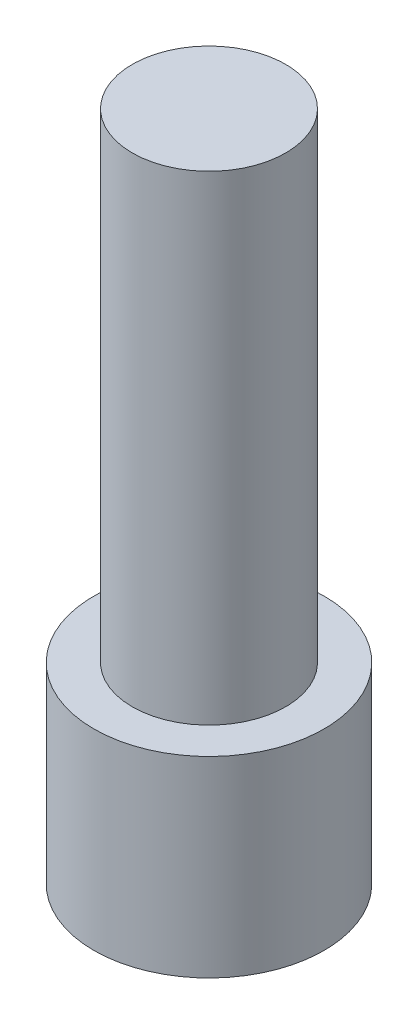
ISO-10303-21;
HEADER;
FILE_DESCRIPTION(('STEP AP214'),'2;1');
FILE_NAME('part.step','',(''),(''),'','','');
FILE_SCHEMA(('AUTOMOTIVE_DESIGN { 1 0 10303 214 1 1 1 1 }'));
ENDSEC;
DATA;
#1=APPLICATION_CONTEXT('core data for automotive mechanical design processes');
#2=APPLICATION_PROTOCOL_DEFINITION('international standard','automotive_design',2000,#1);
#3=PRODUCT_CONTEXT('',#1,'mechanical');
#4=PRODUCT('Part','Part','',(#3));
#5=PRODUCT_RELATED_PRODUCT_CATEGORY('part','',(#4));
#6=PRODUCT_DEFINITION_FORMATION('','',#4);
#7=PRODUCT_DEFINITION_CONTEXT('part definition',#1,'design');
#8=PRODUCT_DEFINITION('design','',#6,#7);
#9=PRODUCT_DEFINITION_SHAPE('','',#8);
#10=(LENGTH_UNIT() NAMED_UNIT(*) SI_UNIT(.MILLI.,.METRE.));
#11=(NAMED_UNIT(*) PLANE_ANGLE_UNIT() SI_UNIT($,.RADIAN.));
#12=(NAMED_UNIT(*) SI_UNIT($,.STERADIAN.) SOLID_ANGLE_UNIT());
#13=UNCERTAINTY_MEASURE_WITH_UNIT(LENGTH_MEASURE(1.E-05),#10,'distance_accuracy_value','');
#14=(GEOMETRIC_REPRESENTATION_CONTEXT(3) GLOBAL_UNCERTAINTY_ASSIGNED_CONTEXT((#13)) GLOBAL_UNIT_ASSIGNED_CONTEXT((#10,
#11,#12)) REPRESENTATION_CONTEXT('',''));
#15=CARTESIAN_POINT('',(0.,0.,0.));
#16=DIRECTION('',(0.,0.,1.));
#17=DIRECTION('',(1.,0.,0.));
#18=AXIS2_PLACEMENT_3D('',#15,#16,#17);
#19=CARTESIAN_POINT('',(0.,25.,0.));
#20=DIRECTION('',(0.,-1.,0.));
#21=DIRECTION('',(0.,0.,-1.));
#22=AXIS2_PLACEMENT_3D('',#19,#20,#21);
#23=CYLINDRICAL_SURFACE('',#22,4.);
#24=CARTESIAN_POINT('',(0.,25.,0.));
#25=DIRECTION('',(0.,1.,0.));
#26=DIRECTION('',(0.,0.,1.));
#27=AXIS2_PLACEMENT_3D('',#24,#25,#26);
#28=CIRCLE('',#27,4.);
#29=CARTESIAN_POINT('',(0.,25.,4.));
#30=VERTEX_POINT('',#29);
#31=EDGE_CURVE('E12',#30,#30,#28,.T.);
#32=ORIENTED_EDGE('',*,*,#31,.F.);
#33=EDGE_LOOP('',(#32));
#34=FACE_BOUND('',#33,.T.);
#35=CARTESIAN_POINT('',(0.,0.,0.));
#36=DIRECTION('',(0.,1.,0.));
#37=DIRECTION('',(0.,0.,1.));
#38=AXIS2_PLACEMENT_3D('',#35,#36,#37);
#39=CIRCLE('',#38,4.);
#40=CARTESIAN_POINT('',(0.,0.,4.));
#41=VERTEX_POINT('',#40);
#42=EDGE_CURVE('E66',#41,#41,#39,.T.);
#43=ORIENTED_EDGE('',*,*,#42,.T.);
#44=EDGE_LOOP('',(#43));
#45=FACE_BOUND('',#44,.T.);
#46=ADVANCED_FACE('F63',(#34,#45),#23,.T.);
#47=CARTESIAN_POINT('',(0.,25.,0.));
#48=DIRECTION('',(0.,1.,0.));
#49=DIRECTION('',(0.,0.,1.));
#50=AXIS2_PLACEMENT_3D('',#47,#48,#49);
#51=PLANE('',#50);
#52=ORIENTED_EDGE('',*,*,#31,.T.);
#53=EDGE_LOOP('',(#52));
#54=FACE_BOUND('',#53,.T.);
#55=ADVANCED_FACE('F202',(#54),#51,.T.);
#56=CARTESIAN_POINT('',(0.,0.,0.));
#57=DIRECTION('',(0.,-1.,0.));
#58=DIRECTION('',(0.,0.,-1.));
#59=AXIS2_PLACEMENT_3D('',#56,#57,#58);
#60=PLANE('',#59);
#61=ORIENTED_EDGE('',*,*,#42,.F.);
#62=EDGE_LOOP('',(#61));
#63=FACE_BOUND('',#62,.T.);
#64=CARTESIAN_POINT('',(0.,0.,0.));
#65=DIRECTION('',(0.,-1.,0.));
#66=DIRECTION('',(0.,0.,-1.));
#67=AXIS2_PLACEMENT_3D('',#64,#65,#66);
#68=CIRCLE('',#67,6.);
#69=CARTESIAN_POINT('',(0.,0.,-6.));
#70=VERTEX_POINT('',#69);
#71=EDGE_CURVE('E188',#70,#70,#68,.T.);
#72=ORIENTED_EDGE('',*,*,#71,.F.);
#73=EDGE_LOOP('',(#72));
#74=FACE_BOUND('',#73,.T.);
#75=ADVANCED_FACE('F198',(#63,#74),#60,.F.);
#76=CARTESIAN_POINT('',(0.,-3.,0.));
#77=DIRECTION('',(0.,1.,0.));
#78=DIRECTION('',(0.,0.,1.));
#79=AXIS2_PLACEMENT_3D('',#76,#77,#78);
#80=CYLINDRICAL_SURFACE('',#79,6.);
#81=ORIENTED_EDGE('',*,*,#71,.T.);
#82=EDGE_LOOP('',(#81));
#83=FACE_BOUND('',#82,.T.);
#84=CARTESIAN_POINT('',(0.,-10.,0.));
#85=DIRECTION('',(0.,-1.,0.));
#86=DIRECTION('',(0.,0.,-1.));
#87=AXIS2_PLACEMENT_3D('',#84,#85,#86);
#88=CIRCLE('',#87,6.);
#89=CARTESIAN_POINT('',(0.,-10.,-6.));
#90=VERTEX_POINT('',#89);
#91=EDGE_CURVE('E132',#90,#90,#88,.T.);
#92=ORIENTED_EDGE('',*,*,#91,.F.);
#93=EDGE_LOOP('',(#92));
#94=FACE_BOUND('',#93,.T.);
#95=ADVANCED_FACE('F201',(#83,#94),#80,.T.);
#96=CARTESIAN_POINT('',(0.,-10.,0.));
#97=DIRECTION('',(0.,-1.,0.));
#98=DIRECTION('',(0.,0.,-1.));
#99=AXIS2_PLACEMENT_3D('',#96,#97,#98);
#100=PLANE('',#99);
#101=ORIENTED_EDGE('',*,*,#91,.T.);
#102=EDGE_LOOP('',(#101));
#103=FACE_BOUND('',#102,.T.);
#104=DIRECTION('',(-0.5,0.,0.866025403784438));
#105=VECTOR('',#104,1.);
#106=CARTESIAN_POINT('',(4.61880215351701,-10.,0.));
#107=LINE('',#106,#105);
#108=CARTESIAN_POINT('',(4.61880215351701,-10.,0.));
#109=VERTEX_POINT('',#108);
#110=CARTESIAN_POINT('',(2.3094010767585,-10.,4.));
#111=VERTEX_POINT('',#110);
#112=EDGE_CURVE('E125',#109,#111,#107,.T.);
#113=ORIENTED_EDGE('',*,*,#112,.F.);
#114=DIRECTION('',(0.5,0.,0.866025403784439));
#115=VECTOR('',#114,1.);
#116=CARTESIAN_POINT('',(2.3094010767585,-10.,-4.));
#117=LINE('',#116,#115);
#118=CARTESIAN_POINT('',(2.3094010767585,-10.,-4.));
#119=VERTEX_POINT('',#118);
#120=EDGE_CURVE('E115',#119,#109,#117,.T.);
#121=ORIENTED_EDGE('',*,*,#120,.F.);
#122=DIRECTION('',(1.,0.,0.));
#123=VECTOR('',#122,1.);
#124=CARTESIAN_POINT('',(-2.3094010767585,-10.,-4.));
#125=LINE('',#124,#123);
#126=CARTESIAN_POINT('',(-2.3094010767585,-10.,-4.));
#127=VERTEX_POINT('',#126);
#128=EDGE_CURVE('E151',#127,#119,#125,.T.);
#129=ORIENTED_EDGE('',*,*,#128,.F.);
#130=DIRECTION('',(0.5,0.,-0.866025403784438));
#131=VECTOR('',#130,1.);
#132=CARTESIAN_POINT('',(-4.61880215351701,-10.,0.));
#133=LINE('',#132,#131);
#134=CARTESIAN_POINT('',(-4.61880215351701,-10.,0.));
#135=VERTEX_POINT('',#134);
#136=EDGE_CURVE('E147',#135,#127,#133,.T.);
#137=ORIENTED_EDGE('',*,*,#136,.F.);
#138=DIRECTION('',(-0.5,0.,-0.866025403784439));
#139=VECTOR('',#138,1.);
#140=CARTESIAN_POINT('',(-2.3094010767585,-10.,4.));
#141=LINE('',#140,#139);
#142=CARTESIAN_POINT('',(-2.3094010767585,-10.,4.));
#143=VERTEX_POINT('',#142);
#144=EDGE_CURVE('E142',#143,#135,#141,.T.);
#145=ORIENTED_EDGE('',*,*,#144,.F.);
#146=DIRECTION('',(-1.,0.,0.));
#147=VECTOR('',#146,1.);
#148=CARTESIAN_POINT('',(2.3094010767585,-10.,4.));
#149=LINE('',#148,#147);
#150=EDGE_CURVE('E138',#111,#143,#149,.T.);
#151=ORIENTED_EDGE('',*,*,#150,.F.);
#152=EDGE_LOOP('',(#113,#121,#129,#137,#145,#151));
#153=FACE_BOUND('',#152,.T.);
#154=ADVANCED_FACE('F136',(#103,#153),#100,.T.);
#155=CARTESIAN_POINT('',(2.3094010767585,-10.,-4.));
#156=DIRECTION('',(-0.866025403784439,0.,0.5));
#157=DIRECTION('',(0.5,0.,0.866025403784439));
#158=AXIS2_PLACEMENT_3D('',#155,#156,#157);
#159=PLANE('',#158);
#160=DIRECTION('',(0.5,0.,0.866025403784439));
#161=VECTOR('',#160,1.);
#162=CARTESIAN_POINT('',(2.3094010767585,-3.,-4.));
#163=LINE('',#162,#161);
#164=CARTESIAN_POINT('',(2.3094010767585,-3.,-4.));
#165=VERTEX_POINT('',#164);
#166=CARTESIAN_POINT('',(4.61880215351701,-3.,0.));
#167=VERTEX_POINT('',#166);
#168=EDGE_CURVE('E78',#165,#167,#163,.T.);
#169=ORIENTED_EDGE('',*,*,#168,.F.);
#170=DIRECTION('',(0.,1.,0.));
#171=VECTOR('',#170,1.);
#172=CARTESIAN_POINT('',(2.3094010767585,-10.,-4.));
#173=LINE('',#172,#171);
#174=EDGE_CURVE('E120',#119,#165,#173,.T.);
#175=ORIENTED_EDGE('',*,*,#174,.F.);
#176=ORIENTED_EDGE('',*,*,#120,.T.);
#177=DIRECTION('',(0.,1.,0.));
#178=VECTOR('',#177,1.);
#179=CARTESIAN_POINT('',(4.61880215351701,-10.,0.));
#180=LINE('',#179,#178);
#181=EDGE_CURVE('E118',#109,#167,#180,.T.);
#182=ORIENTED_EDGE('',*,*,#181,.T.);
#183=EDGE_LOOP('',(#169,#175,#176,#182));
#184=FACE_BOUND('',#183,.T.);
#185=ADVANCED_FACE('F117',(#184),#159,.T.);
#186=CARTESIAN_POINT('',(4.61880215351701,-10.,0.));
#187=DIRECTION('',(-0.866025403784438,0.,-0.5));
#188=DIRECTION('',(-0.5,0.,0.866025403784438));
#189=AXIS2_PLACEMENT_3D('',#186,#187,#188);
#190=PLANE('',#189);
#191=DIRECTION('',(-0.5,0.,0.866025403784438));
#192=VECTOR('',#191,1.);
#193=CARTESIAN_POINT('',(4.61880215351701,-3.,0.));
#194=LINE('',#193,#192);
#195=CARTESIAN_POINT('',(2.3094010767585,-3.,4.));
#196=VERTEX_POINT('',#195);
#197=EDGE_CURVE('E82',#167,#196,#194,.T.);
#198=ORIENTED_EDGE('',*,*,#197,.F.);
#199=ORIENTED_EDGE('',*,*,#181,.F.);
#200=ORIENTED_EDGE('',*,*,#112,.T.);
#201=DIRECTION('',(0.,1.,0.));
#202=VECTOR('',#201,1.);
#203=CARTESIAN_POINT('',(2.3094010767585,-10.,4.));
#204=LINE('',#203,#202);
#205=EDGE_CURVE('E133',#111,#196,#204,.T.);
#206=ORIENTED_EDGE('',*,*,#205,.T.);
#207=EDGE_LOOP('',(#198,#199,#200,#206));
#208=FACE_BOUND('',#207,.T.);
#209=ADVANCED_FACE('F129',(#208),#190,.T.);
#210=CARTESIAN_POINT('',(2.3094010767585,-10.,4.));
#211=DIRECTION('',(0.,0.,-1.));
#212=DIRECTION('',(-1.,0.,0.));
#213=AXIS2_PLACEMENT_3D('',#210,#211,#212);
#214=PLANE('',#213);
#215=DIRECTION('',(-1.,0.,0.));
#216=VECTOR('',#215,1.);
#217=CARTESIAN_POINT('',(2.3094010767585,-3.,4.));
#218=LINE('',#217,#216);
#219=CARTESIAN_POINT('',(-2.3094010767585,-3.,4.));
#220=VERTEX_POINT('',#219);
#221=EDGE_CURVE('E158',#196,#220,#218,.T.);
#222=ORIENTED_EDGE('',*,*,#221,.F.);
#223=ORIENTED_EDGE('',*,*,#205,.F.);
#224=ORIENTED_EDGE('',*,*,#150,.T.);
#225=DIRECTION('',(0.,1.,0.));
#226=VECTOR('',#225,1.);
#227=CARTESIAN_POINT('',(-2.3094010767585,-10.,4.));
#228=LINE('',#227,#226);
#229=EDGE_CURVE('E179',#143,#220,#228,.T.);
#230=ORIENTED_EDGE('',*,*,#229,.T.);
#231=EDGE_LOOP('',(#222,#223,#224,#230));
#232=FACE_BOUND('',#231,.T.);
#233=ADVANCED_FACE('F264',(#232),#214,.T.);
#234=CARTESIAN_POINT('',(-2.3094010767585,-10.,4.));
#235=DIRECTION('',(0.866025403784439,0.,-0.5));
#236=DIRECTION('',(-0.5,0.,-0.866025403784439));
#237=AXIS2_PLACEMENT_3D('',#234,#235,#236);
#238=PLANE('',#237);
#239=DIRECTION('',(-0.5,0.,-0.866025403784439));
#240=VECTOR('',#239,1.);
#241=CARTESIAN_POINT('',(-2.3094010767585,-3.,4.));
#242=LINE('',#241,#240);
#243=CARTESIAN_POINT('',(-4.61880215351701,-3.,0.));
#244=VERTEX_POINT('',#243);
#245=EDGE_CURVE('E161',#220,#244,#242,.T.);
#246=ORIENTED_EDGE('',*,*,#245,.F.);
#247=ORIENTED_EDGE('',*,*,#229,.F.);
#248=ORIENTED_EDGE('',*,*,#144,.T.);
#249=DIRECTION('',(0.,1.,0.));
#250=VECTOR('',#249,1.);
#251=CARTESIAN_POINT('',(-4.61880215351701,-10.,0.));
#252=LINE('',#251,#250);
#253=EDGE_CURVE('E175',#135,#244,#252,.T.);
#254=ORIENTED_EDGE('',*,*,#253,.T.);
#255=EDGE_LOOP('',(#246,#247,#248,#254));
#256=FACE_BOUND('',#255,.T.);
#257=ADVANCED_FACE('F274',(#256),#238,.T.);
#258=CARTESIAN_POINT('',(-4.61880215351701,-10.,0.));
#259=DIRECTION('',(0.866025403784438,0.,0.5));
#260=DIRECTION('',(0.5,0.,-0.866025403784439));
#261=AXIS2_PLACEMENT_3D('',#258,#259,#260);
#262=PLANE('',#261);
#263=DIRECTION('',(0.5,0.,-0.866025403784438));
#264=VECTOR('',#263,1.);
#265=CARTESIAN_POINT('',(-4.61880215351701,-3.,0.));
#266=LINE('',#265,#264);
#267=CARTESIAN_POINT('',(-2.3094010767585,-3.,-4.));
#268=VERTEX_POINT('',#267);
#269=EDGE_CURVE('E164',#244,#268,#266,.T.);
#270=ORIENTED_EDGE('',*,*,#269,.F.);
#271=ORIENTED_EDGE('',*,*,#253,.F.);
#272=ORIENTED_EDGE('',*,*,#136,.T.);
#273=DIRECTION('',(0.,1.,0.));
#274=VECTOR('',#273,1.);
#275=CARTESIAN_POINT('',(-2.3094010767585,-10.,-4.));
#276=LINE('',#275,#274);
#277=EDGE_CURVE('E171',#127,#268,#276,.T.);
#278=ORIENTED_EDGE('',*,*,#277,.T.);
#279=EDGE_LOOP('',(#270,#271,#272,#278));
#280=FACE_BOUND('',#279,.T.);
#281=ADVANCED_FACE('F285',(#280),#262,.T.);
#282=CARTESIAN_POINT('',(-2.3094010767585,-10.,-4.));
#283=DIRECTION('',(0.,0.,1.));
#284=DIRECTION('',(1.,0.,0.));
#285=AXIS2_PLACEMENT_3D('',#282,#283,#284);
#286=PLANE('',#285);
#287=DIRECTION('',(1.,0.,0.));
#288=VECTOR('',#287,1.);
#289=CARTESIAN_POINT('',(-2.3094010767585,-3.,-4.));
#290=LINE('',#289,#288);
#291=EDGE_CURVE('E126',#268,#165,#290,.T.);
#292=ORIENTED_EDGE('',*,*,#291,.F.);
#293=ORIENTED_EDGE('',*,*,#277,.F.);
#294=ORIENTED_EDGE('',*,*,#128,.T.);
#295=ORIENTED_EDGE('',*,*,#174,.T.);
#296=EDGE_LOOP('',(#292,#293,#294,#295));
#297=FACE_BOUND('',#296,.T.);
#298=ADVANCED_FACE('F296',(#297),#286,.T.);
#299=CARTESIAN_POINT('',(0.,-3.,0.));
#300=DIRECTION('',(0.,-1.,0.));
#301=DIRECTION('',(0.,0.,-1.));
#302=AXIS2_PLACEMENT_3D('',#299,#300,#301);
#303=PLANE('',#302);
#304=ORIENTED_EDGE('',*,*,#168,.T.);
#305=ORIENTED_EDGE('',*,*,#197,.T.);
#306=ORIENTED_EDGE('',*,*,#221,.T.);
#307=ORIENTED_EDGE('',*,*,#245,.T.);
#308=ORIENTED_EDGE('',*,*,#269,.T.);
#309=ORIENTED_EDGE('',*,*,#291,.T.);
#310=EDGE_LOOP('',(#304,#305,#306,#307,#308,#309));
#311=FACE_BOUND('',#310,.T.);
#312=ADVANCED_FACE('F307',(#311),#303,.T.);
#313=CLOSED_SHELL('',(#46,#55,#75,#95,#154,#185,#209,#233,#257,#281,#298,#312));
#314=MANIFOLD_SOLID_BREP('B2',#313);
#315=ADVANCED_BREP_SHAPE_REPRESENTATION('',(#18,#314),#14);
#316=SHAPE_DEFINITION_REPRESENTATION(#9,#315);
ENDSEC;
END-ISO-10303-21;
